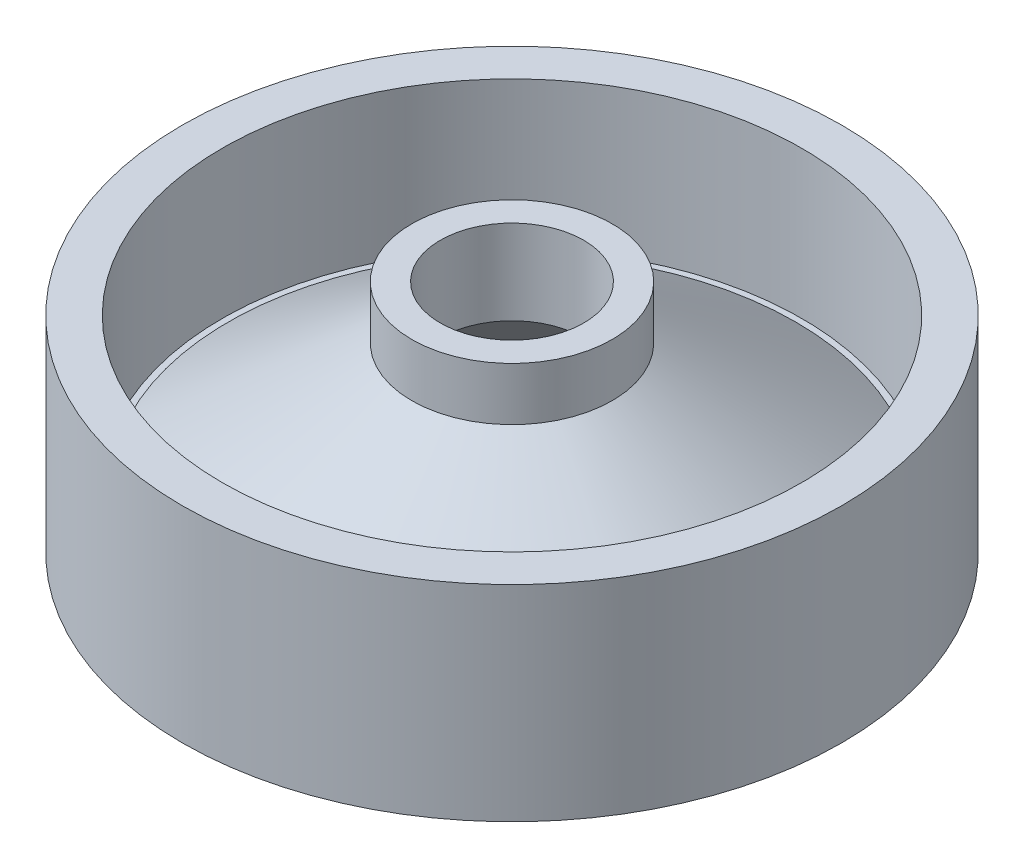
ISO-10303-21;
HEADER;
FILE_DESCRIPTION(('STEP AP214'),'2;1');
FILE_NAME('part.step','',(''),(''),'','','');
FILE_SCHEMA(('AUTOMOTIVE_DESIGN { 1 0 10303 214 1 1 1 1 }'));
ENDSEC;
DATA;
#1=APPLICATION_CONTEXT('core data for automotive mechanical design processes');
#2=APPLICATION_PROTOCOL_DEFINITION('international standard','automotive_design',2000,#1);
#3=PRODUCT_CONTEXT('',#1,'mechanical');
#4=PRODUCT('Part','Part','',(#3));
#5=PRODUCT_RELATED_PRODUCT_CATEGORY('part','',(#4));
#6=PRODUCT_DEFINITION_FORMATION('','',#4);
#7=PRODUCT_DEFINITION_CONTEXT('part definition',#1,'design');
#8=PRODUCT_DEFINITION('design','',#6,#7);
#9=PRODUCT_DEFINITION_SHAPE('','',#8);
#10=(LENGTH_UNIT() NAMED_UNIT(*) SI_UNIT(.MILLI.,.METRE.));
#11=(NAMED_UNIT(*) PLANE_ANGLE_UNIT() SI_UNIT($,.RADIAN.));
#12=(NAMED_UNIT(*) SI_UNIT($,.STERADIAN.) SOLID_ANGLE_UNIT());
#13=UNCERTAINTY_MEASURE_WITH_UNIT(LENGTH_MEASURE(1.E-05),#10,'distance_accuracy_value','');
#14=(GEOMETRIC_REPRESENTATION_CONTEXT(3) GLOBAL_UNCERTAINTY_ASSIGNED_CONTEXT((#13)) GLOBAL_UNIT_ASSIGNED_CONTEXT((#10,
#11,#12)) REPRESENTATION_CONTEXT('',''));
#15=CARTESIAN_POINT('',(0.,0.,0.));
#16=DIRECTION('',(0.,0.,1.));
#17=DIRECTION('',(1.,0.,0.));
#18=AXIS2_PLACEMENT_3D('',#15,#16,#17);
#19=CARTESIAN_POINT('',(0.,7.09,0.));
#20=DIRECTION('',(0.,-1.,0.));
#21=DIRECTION('',(0.,0.,-1.));
#22=AXIS2_PLACEMENT_3D('',#19,#20,#21);
#23=CYLINDRICAL_SURFACE('',#22,11.38);
#24=CARTESIAN_POINT('',(0.,7.09,0.));
#25=DIRECTION('',(0.,1.,0.));
#26=DIRECTION('',(0.,0.,1.));
#27=AXIS2_PLACEMENT_3D('',#24,#25,#26);
#28=CIRCLE('',#27,11.38);
#29=CARTESIAN_POINT('',(0.,7.09,11.38));
#30=VERTEX_POINT('',#29);
#31=EDGE_CURVE('E40',#30,#30,#28,.T.);
#32=ORIENTED_EDGE('',*,*,#31,.F.);
#33=EDGE_LOOP('',(#32));
#34=FACE_BOUND('',#33,.T.);
#35=CARTESIAN_POINT('',(0.,0.,0.));
#36=DIRECTION('',(0.,1.,0.));
#37=DIRECTION('',(0.,0.,1.));
#38=AXIS2_PLACEMENT_3D('',#35,#36,#37);
#39=CIRCLE('',#38,11.38);
#40=CARTESIAN_POINT('',(0.,0.,11.38));
#41=VERTEX_POINT('',#40);
#42=EDGE_CURVE('E36',#41,#41,#39,.T.);
#43=ORIENTED_EDGE('',*,*,#42,.T.);
#44=EDGE_LOOP('',(#43));
#45=FACE_BOUND('',#44,.T.);
#46=ADVANCED_FACE('F33',(#34,#45),#23,.T.);
#47=CARTESIAN_POINT('',(0.,7.09,0.));
#48=DIRECTION('',(0.,1.,0.));
#49=DIRECTION('',(0.,0.,1.));
#50=AXIS2_PLACEMENT_3D('',#47,#48,#49);
#51=PLANE('',#50);
#52=CARTESIAN_POINT('',(0.,7.09,0.));
#53=DIRECTION('',(0.,1.,0.));
#54=DIRECTION('',(0.,0.,1.));
#55=AXIS2_PLACEMENT_3D('',#52,#53,#54);
#56=CIRCLE('',#55,10.);
#57=CARTESIAN_POINT('',(0.,7.09,10.));
#58=VERTEX_POINT('',#57);
#59=EDGE_CURVE('E52',#58,#58,#56,.T.);
#60=ORIENTED_EDGE('',*,*,#59,.F.);
#61=EDGE_LOOP('',(#60));
#62=FACE_BOUND('',#61,.T.);
#63=ORIENTED_EDGE('',*,*,#31,.T.);
#64=EDGE_LOOP('',(#63));
#65=FACE_BOUND('',#64,.T.);
#66=ADVANCED_FACE('F61',(#62,#65),#51,.T.);
#67=CARTESIAN_POINT('',(0.,0.,0.));
#68=DIRECTION('',(0.,1.,0.));
#69=DIRECTION('',(0.,0.,1.));
#70=AXIS2_PLACEMENT_3D('',#67,#68,#69);
#71=PLANE('',#70);
#72=CARTESIAN_POINT('',(0.,0.,0.));
#73=DIRECTION('',(0.,-1.,0.));
#74=DIRECTION('',(0.,0.,-1.));
#75=AXIS2_PLACEMENT_3D('',#72,#73,#74);
#76=CIRCLE('',#75,8.87312981147934);
#77=CARTESIAN_POINT('',(0.,0.,-8.87312981147934));
#78=VERTEX_POINT('',#77);
#79=EDGE_CURVE('E114',#78,#78,#76,.T.);
#80=ORIENTED_EDGE('',*,*,#79,.F.);
#81=EDGE_LOOP('',(#80));
#82=FACE_BOUND('',#81,.T.);
#83=ORIENTED_EDGE('',*,*,#42,.F.);
#84=EDGE_LOOP('',(#83));
#85=FACE_BOUND('',#84,.T.);
#86=ADVANCED_FACE('F64',(#82,#85),#71,.F.);
#87=CARTESIAN_POINT('',(0.,2.,0.));
#88=DIRECTION('',(0.,1.,0.));
#89=DIRECTION('',(0.,0.,1.));
#90=AXIS2_PLACEMENT_3D('',#87,#88,#89);
#91=CYLINDRICAL_SURFACE('',#90,10.);
#92=CARTESIAN_POINT('',(0.,2.,0.));
#93=DIRECTION('',(0.,1.,0.));
#94=DIRECTION('',(0.,0.,1.));
#95=AXIS2_PLACEMENT_3D('',#92,#93,#94);
#96=CIRCLE('',#95,10.);
#97=CARTESIAN_POINT('',(0.,2.,10.));
#98=VERTEX_POINT('',#97);
#99=EDGE_CURVE('E53',#98,#98,#96,.T.);
#100=ORIENTED_EDGE('',*,*,#99,.F.);
#101=EDGE_LOOP('',(#100));
#102=FACE_BOUND('',#101,.T.);
#103=ORIENTED_EDGE('',*,*,#59,.T.);
#104=EDGE_LOOP('',(#103));
#105=FACE_BOUND('',#104,.T.);
#106=ADVANCED_FACE('F59',(#102,#105),#91,.F.);
#107=CARTESIAN_POINT('',(0.,2.,0.));
#108=DIRECTION('',(0.,1.,0.));
#109=DIRECTION('',(0.,0.,1.));
#110=AXIS2_PLACEMENT_3D('',#107,#108,#109);
#111=PLANE('',#110);
#112=CARTESIAN_POINT('',(0.,2.,0.));
#113=DIRECTION('',(0.,1.,0.));
#114=DIRECTION('',(0.,0.,1.));
#115=AXIS2_PLACEMENT_3D('',#112,#113,#114);
#116=CIRCLE('',#115,9.79053533554941);
#117=CARTESIAN_POINT('',(0.,2.,9.79053533554941));
#118=VERTEX_POINT('',#117);
#119=EDGE_CURVE('E10',#118,#118,#116,.T.);
#120=ORIENTED_EDGE('',*,*,#119,.F.);
#121=EDGE_LOOP('',(#120));
#122=FACE_BOUND('',#121,.T.);
#123=ORIENTED_EDGE('',*,*,#99,.T.);
#124=EDGE_LOOP('',(#123));
#125=FACE_BOUND('',#124,.T.);
#126=ADVANCED_FACE('F78',(#122,#125),#111,.T.);
#127=CARTESIAN_POINT('',(0.,6.27,0.));
#128=DIRECTION('',(0.,-1.,0.));
#129=DIRECTION('',(0.,0.,1.));
#130=AXIS2_PLACEMENT_3D('',#127,#128,#129);
#131=CONICAL_SURFACE('',#130,3.46,0.977384381116826);
#132=ORIENTED_EDGE('',*,*,#119,.T.);
#133=EDGE_LOOP('',(#132));
#134=FACE_BOUND('',#133,.T.);
#135=CARTESIAN_POINT('',(0.,6.27,0.));
#136=DIRECTION('',(0.,1.,0.));
#137=DIRECTION('',(0.,0.,1.));
#138=AXIS2_PLACEMENT_3D('',#135,#136,#137);
#139=CIRCLE('',#138,3.46);
#140=CARTESIAN_POINT('',(0.,6.27,3.46));
#141=VERTEX_POINT('',#140);
#142=EDGE_CURVE('E47',#141,#141,#139,.T.);
#143=ORIENTED_EDGE('',*,*,#142,.F.);
#144=EDGE_LOOP('',(#143));
#145=FACE_BOUND('',#144,.T.);
#146=ADVANCED_FACE('F85',(#134,#145),#131,.T.);
#147=CARTESIAN_POINT('',(0.,8.1,0.));
#148=DIRECTION('',(0.,1.,0.));
#149=DIRECTION('',(0.,0.,1.));
#150=AXIS2_PLACEMENT_3D('',#147,#148,#149);
#151=PLANE('',#150);
#152=CARTESIAN_POINT('',(0.,8.1,0.));
#153=DIRECTION('',(0.,-1.,0.));
#154=DIRECTION('',(0.,0.,-1.));
#155=AXIS2_PLACEMENT_3D('',#152,#153,#154);
#156=CIRCLE('',#155,2.47636254062776);
#157=CARTESIAN_POINT('',(0.,8.1,-2.47636254062776));
#158=VERTEX_POINT('',#157);
#159=EDGE_CURVE('E109',#158,#158,#156,.T.);
#160=ORIENTED_EDGE('',*,*,#159,.T.);
#161=EDGE_LOOP('',(#160));
#162=FACE_BOUND('',#161,.T.);
#163=CARTESIAN_POINT('',(0.,8.1,0.));
#164=DIRECTION('',(0.,1.,0.));
#165=DIRECTION('',(0.,0.,1.));
#166=AXIS2_PLACEMENT_3D('',#163,#164,#165);
#167=CIRCLE('',#166,3.46);
#168=CARTESIAN_POINT('',(0.,8.1,3.46));
#169=VERTEX_POINT('',#168);
#170=EDGE_CURVE('E49',#169,#169,#167,.T.);
#171=ORIENTED_EDGE('',*,*,#170,.T.);
#172=EDGE_LOOP('',(#171));
#173=FACE_BOUND('',#172,.T.);
#174=ADVANCED_FACE('F91',(#162,#173),#151,.T.);
#175=CARTESIAN_POINT('',(0.,8.1,0.));
#176=DIRECTION('',(0.,-1.,0.));
#177=DIRECTION('',(0.,0.,-1.));
#178=AXIS2_PLACEMENT_3D('',#175,#176,#177);
#179=CYLINDRICAL_SURFACE('',#178,3.46);
#180=ORIENTED_EDGE('',*,*,#142,.T.);
#181=EDGE_LOOP('',(#180));
#182=FACE_BOUND('',#181,.T.);
#183=ORIENTED_EDGE('',*,*,#170,.F.);
#184=EDGE_LOOP('',(#183));
#185=FACE_BOUND('',#184,.T.);
#186=ADVANCED_FACE('F87',(#182,#185),#179,.T.);
#187=CARTESIAN_POINT('',(0.,0.,0.));
#188=DIRECTION('',(0.,-1.,0.));
#189=DIRECTION('',(0.,0.,-1.));
#190=AXIS2_PLACEMENT_3D('',#187,#188,#189);
#191=CONICAL_SURFACE('',#190,8.87312981147934,0.890117918517109);
#192=CARTESIAN_POINT('',(0.,5.18,0.));
#193=DIRECTION('',(0.,-1.,0.));
#194=DIRECTION('',(0.,0.,-1.));
#195=AXIS2_PLACEMENT_3D('',#192,#193,#194);
#196=CIRCLE('',#195,2.47636254062776);
#197=CARTESIAN_POINT('',(0.,5.18,-2.47636254062776));
#198=VERTEX_POINT('',#197);
#199=EDGE_CURVE('E112',#198,#198,#196,.T.);
#200=ORIENTED_EDGE('',*,*,#199,.F.);
#201=EDGE_LOOP('',(#200));
#202=FACE_BOUND('',#201,.T.);
#203=ORIENTED_EDGE('',*,*,#79,.T.);
#204=EDGE_LOOP('',(#203));
#205=FACE_BOUND('',#204,.T.);
#206=ADVANCED_FACE('F90',(#202,#205),#191,.F.);
#207=CARTESIAN_POINT('',(0.,8.1,0.));
#208=DIRECTION('',(0.,-1.,0.));
#209=DIRECTION('',(0.,0.,-1.));
#210=AXIS2_PLACEMENT_3D('',#207,#208,#209);
#211=CYLINDRICAL_SURFACE('',#210,2.47636254062776);
#212=ORIENTED_EDGE('',*,*,#159,.F.);
#213=EDGE_LOOP('',(#212));
#214=FACE_BOUND('',#213,.T.);
#215=ORIENTED_EDGE('',*,*,#199,.T.);
#216=EDGE_LOOP('',(#215));
#217=FACE_BOUND('',#216,.T.);
#218=ADVANCED_FACE('F100',(#214,#217),#211,.F.);
#219=CLOSED_SHELL('',(#46,#66,#86,#106,#126,#146,#174,#186,#206,#218));
#220=MANIFOLD_SOLID_BREP('B2',#219);
#221=ADVANCED_BREP_SHAPE_REPRESENTATION('',(#18,#220),#14);
#222=SHAPE_DEFINITION_REPRESENTATION(#9,#221);
ENDSEC;
END-ISO-10303-21;
